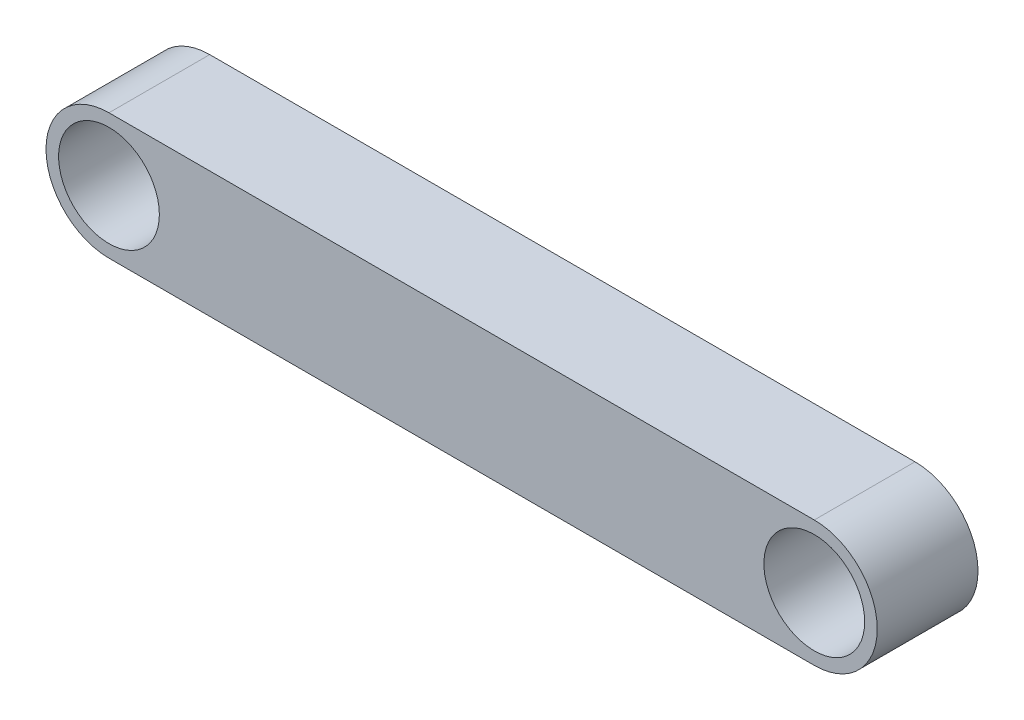
ISO-10303-21;
HEADER;
FILE_DESCRIPTION(('STEP AP214'),'2;1');
FILE_NAME('part.step','',(''),(''),'','','');
FILE_SCHEMA(('AUTOMOTIVE_DESIGN { 1 0 10303 214 1 1 1 1 }'));
ENDSEC;
DATA;
#1=APPLICATION_CONTEXT('core data for automotive mechanical design processes');
#2=APPLICATION_PROTOCOL_DEFINITION('international standard','automotive_design',2000,#1);
#3=PRODUCT_CONTEXT('',#1,'mechanical');
#4=PRODUCT('Part','Part','',(#3));
#5=PRODUCT_RELATED_PRODUCT_CATEGORY('part','',(#4));
#6=PRODUCT_DEFINITION_FORMATION('','',#4);
#7=PRODUCT_DEFINITION_CONTEXT('part definition',#1,'design');
#8=PRODUCT_DEFINITION('design','',#6,#7);
#9=PRODUCT_DEFINITION_SHAPE('','',#8);
#10=(LENGTH_UNIT() NAMED_UNIT(*) SI_UNIT(.MILLI.,.METRE.));
#11=(NAMED_UNIT(*) PLANE_ANGLE_UNIT() SI_UNIT($,.RADIAN.));
#12=(NAMED_UNIT(*) SI_UNIT($,.STERADIAN.) SOLID_ANGLE_UNIT());
#13=UNCERTAINTY_MEASURE_WITH_UNIT(LENGTH_MEASURE(1.E-05),#10,'distance_accuracy_value','');
#14=(GEOMETRIC_REPRESENTATION_CONTEXT(3) GLOBAL_UNCERTAINTY_ASSIGNED_CONTEXT((#13)) GLOBAL_UNIT_ASSIGNED_CONTEXT((#10,
#11,#12)) REPRESENTATION_CONTEXT('',''));
#15=CARTESIAN_POINT('',(0.,0.,0.));
#16=DIRECTION('',(0.,0.,1.));
#17=DIRECTION('',(1.,0.,0.));
#18=AXIS2_PLACEMENT_3D('',#15,#16,#17);
#19=CARTESIAN_POINT('',(0.,0.,10.));
#20=DIRECTION('',(0.,0.,1.));
#21=DIRECTION('',(1.,0.,0.));
#22=AXIS2_PLACEMENT_3D('',#19,#20,#21);
#23=PLANE('',#22);
#24=CARTESIAN_POINT('',(0.,0.,10.));
#25=DIRECTION('',(0.,0.,1.));
#26=DIRECTION('',(1.,0.,0.));
#27=AXIS2_PLACEMENT_3D('',#24,#25,#26);
#28=CIRCLE('',#27,10.);
#29=CARTESIAN_POINT('',(10.,0.,10.));
#30=VERTEX_POINT('',#29);
#31=EDGE_CURVE('E118',#30,#30,#28,.T.);
#32=ORIENTED_EDGE('',*,*,#31,.F.);
#33=EDGE_LOOP('',(#32));
#34=FACE_BOUND('',#33,.T.);
#35=CARTESIAN_POINT('',(0.,0.,10.));
#36=DIRECTION('',(0.,0.,1.));
#37=DIRECTION('',(1.,0.,0.));
#38=AXIS2_PLACEMENT_3D('',#35,#36,#37);
#39=CIRCLE('',#38,12.5);
#40=CARTESIAN_POINT('',(0.,12.5,10.));
#41=VERTEX_POINT('',#40);
#42=CARTESIAN_POINT('',(0.,-12.5,10.));
#43=VERTEX_POINT('',#42);
#44=EDGE_CURVE('E98',#41,#43,#39,.T.);
#45=ORIENTED_EDGE('',*,*,#44,.T.);
#46=DIRECTION('',(1.,0.,0.));
#47=VECTOR('',#46,1.);
#48=CARTESIAN_POINT('',(0.,-12.5,10.));
#49=LINE('',#48,#47);
#50=CARTESIAN_POINT('',(140.,-12.5,10.));
#51=VERTEX_POINT('',#50);
#52=EDGE_CURVE('E93',#43,#51,#49,.T.);
#53=ORIENTED_EDGE('',*,*,#52,.T.);
#54=CARTESIAN_POINT('',(140.,0.,10.));
#55=DIRECTION('',(0.,0.,1.));
#56=DIRECTION('',(1.,0.,0.));
#57=AXIS2_PLACEMENT_3D('',#54,#55,#56);
#58=CIRCLE('',#57,12.5);
#59=CARTESIAN_POINT('',(140.,12.5,10.));
#60=VERTEX_POINT('',#59);
#61=EDGE_CURVE('E96',#51,#60,#58,.T.);
#62=ORIENTED_EDGE('',*,*,#61,.T.);
#63=DIRECTION('',(-1.,0.,0.));
#64=VECTOR('',#63,1.);
#65=CARTESIAN_POINT('',(0.,12.5,10.));
#66=LINE('',#65,#64);
#67=EDGE_CURVE('E63',#60,#41,#66,.T.);
#68=ORIENTED_EDGE('',*,*,#67,.T.);
#69=EDGE_LOOP('',(#45,#53,#62,#68));
#70=FACE_BOUND('',#69,.T.);
#71=CARTESIAN_POINT('',(140.,0.,10.));
#72=DIRECTION('',(0.,0.,1.));
#73=DIRECTION('',(1.,0.,0.));
#74=AXIS2_PLACEMENT_3D('',#71,#72,#73);
#75=CIRCLE('',#74,10.);
#76=CARTESIAN_POINT('',(150.,0.,10.));
#77=VERTEX_POINT('',#76);
#78=EDGE_CURVE('E140',#77,#77,#75,.T.);
#79=ORIENTED_EDGE('',*,*,#78,.F.);
#80=EDGE_LOOP('',(#79));
#81=FACE_BOUND('',#80,.T.);
#82=ADVANCED_FACE('F45',(#34,#70,#81),#23,.T.);
#83=CARTESIAN_POINT('',(0.,0.,-10.));
#84=DIRECTION('',(0.,0.,1.));
#85=DIRECTION('',(1.,0.,0.));
#86=AXIS2_PLACEMENT_3D('',#83,#84,#85);
#87=PLANE('',#86);
#88=CARTESIAN_POINT('',(0.,0.,-10.));
#89=DIRECTION('',(0.,0.,1.));
#90=DIRECTION('',(1.,0.,0.));
#91=AXIS2_PLACEMENT_3D('',#88,#89,#90);
#92=CIRCLE('',#91,12.5);
#93=CARTESIAN_POINT('',(0.,12.5,-10.));
#94=VERTEX_POINT('',#93);
#95=CARTESIAN_POINT('',(0.,-12.5,-10.));
#96=VERTEX_POINT('',#95);
#97=EDGE_CURVE('E114',#94,#96,#92,.T.);
#98=ORIENTED_EDGE('',*,*,#97,.F.);
#99=DIRECTION('',(-1.,0.,0.));
#100=VECTOR('',#99,1.);
#101=CARTESIAN_POINT('',(0.,12.5,-10.));
#102=LINE('',#101,#100);
#103=CARTESIAN_POINT('',(140.,12.5,-10.));
#104=VERTEX_POINT('',#103);
#105=EDGE_CURVE('E86',#104,#94,#102,.T.);
#106=ORIENTED_EDGE('',*,*,#105,.F.);
#107=CARTESIAN_POINT('',(140.,0.,-10.));
#108=DIRECTION('',(0.,0.,1.));
#109=DIRECTION('',(1.,0.,0.));
#110=AXIS2_PLACEMENT_3D('',#107,#108,#109);
#111=CIRCLE('',#110,12.5);
#112=CARTESIAN_POINT('',(140.,-12.5,-10.));
#113=VERTEX_POINT('',#112);
#114=EDGE_CURVE('E80',#113,#104,#111,.T.);
#115=ORIENTED_EDGE('',*,*,#114,.F.);
#116=DIRECTION('',(1.,0.,0.));
#117=VECTOR('',#116,1.);
#118=CARTESIAN_POINT('',(0.,-12.5,-10.));
#119=LINE('',#118,#117);
#120=EDGE_CURVE('E103',#96,#113,#119,.T.);
#121=ORIENTED_EDGE('',*,*,#120,.F.);
#122=EDGE_LOOP('',(#98,#106,#115,#121));
#123=FACE_BOUND('',#122,.T.);
#124=CARTESIAN_POINT('',(0.,0.,-10.));
#125=DIRECTION('',(0.,0.,1.));
#126=DIRECTION('',(1.,0.,0.));
#127=AXIS2_PLACEMENT_3D('',#124,#125,#126);
#128=CIRCLE('',#127,10.);
#129=CARTESIAN_POINT('',(10.,0.,-10.));
#130=VERTEX_POINT('',#129);
#131=EDGE_CURVE('E136',#130,#130,#128,.T.);
#132=ORIENTED_EDGE('',*,*,#131,.T.);
#133=EDGE_LOOP('',(#132));
#134=FACE_BOUND('',#133,.T.);
#135=CARTESIAN_POINT('',(140.,0.,-10.));
#136=DIRECTION('',(0.,0.,1.));
#137=DIRECTION('',(1.,0.,0.));
#138=AXIS2_PLACEMENT_3D('',#135,#136,#137);
#139=CIRCLE('',#138,10.);
#140=CARTESIAN_POINT('',(150.,0.,-10.));
#141=VERTEX_POINT('',#140);
#142=EDGE_CURVE('E144',#141,#141,#139,.T.);
#143=ORIENTED_EDGE('',*,*,#142,.T.);
#144=EDGE_LOOP('',(#143));
#145=FACE_BOUND('',#144,.T.);
#146=ADVANCED_FACE('F131',(#123,#134,#145),#87,.F.);
#147=CARTESIAN_POINT('',(0.,0.,10.));
#148=DIRECTION('',(0.,0.,-1.));
#149=DIRECTION('',(-1.,0.,0.));
#150=AXIS2_PLACEMENT_3D('',#147,#148,#149);
#151=CYLINDRICAL_SURFACE('',#150,12.5);
#152=ORIENTED_EDGE('',*,*,#97,.T.);
#153=DIRECTION('',(0.,0.,-1.));
#154=VECTOR('',#153,1.);
#155=CARTESIAN_POINT('',(0.,-12.5,10.));
#156=LINE('',#155,#154);
#157=EDGE_CURVE('E11',#43,#96,#156,.T.);
#158=ORIENTED_EDGE('',*,*,#157,.F.);
#159=ORIENTED_EDGE('',*,*,#44,.F.);
#160=DIRECTION('',(0.,0.,-1.));
#161=VECTOR('',#160,1.);
#162=CARTESIAN_POINT('',(0.,12.5,10.));
#163=LINE('',#162,#161);
#164=EDGE_CURVE('E110',#41,#94,#163,.T.);
#165=ORIENTED_EDGE('',*,*,#164,.T.);
#166=EDGE_LOOP('',(#152,#158,#159,#165));
#167=FACE_BOUND('',#166,.T.);
#168=ADVANCED_FACE('F47',(#167),#151,.T.);
#169=CARTESIAN_POINT('',(0.,-12.5,10.));
#170=DIRECTION('',(0.,1.,0.));
#171=DIRECTION('',(0.,0.,1.));
#172=AXIS2_PLACEMENT_3D('',#169,#170,#171);
#173=PLANE('',#172);
#174=ORIENTED_EDGE('',*,*,#120,.T.);
#175=DIRECTION('',(0.,0.,-1.));
#176=VECTOR('',#175,1.);
#177=CARTESIAN_POINT('',(140.,-12.5,10.));
#178=LINE('',#177,#176);
#179=EDGE_CURVE('E55',#51,#113,#178,.T.);
#180=ORIENTED_EDGE('',*,*,#179,.F.);
#181=ORIENTED_EDGE('',*,*,#52,.F.);
#182=ORIENTED_EDGE('',*,*,#157,.T.);
#183=EDGE_LOOP('',(#174,#180,#181,#182));
#184=FACE_BOUND('',#183,.T.);
#185=ADVANCED_FACE('F102',(#184),#173,.F.);
#186=CARTESIAN_POINT('',(140.,0.,10.));
#187=DIRECTION('',(0.,0.,-1.));
#188=DIRECTION('',(-1.,0.,0.));
#189=AXIS2_PLACEMENT_3D('',#186,#187,#188);
#190=CYLINDRICAL_SURFACE('',#189,12.5);
#191=ORIENTED_EDGE('',*,*,#114,.T.);
#192=DIRECTION('',(0.,0.,-1.));
#193=VECTOR('',#192,1.);
#194=CARTESIAN_POINT('',(140.,12.5,10.));
#195=LINE('',#194,#193);
#196=EDGE_CURVE('E105',#60,#104,#195,.T.);
#197=ORIENTED_EDGE('',*,*,#196,.F.);
#198=ORIENTED_EDGE('',*,*,#61,.F.);
#199=ORIENTED_EDGE('',*,*,#179,.T.);
#200=EDGE_LOOP('',(#191,#197,#198,#199));
#201=FACE_BOUND('',#200,.T.);
#202=ADVANCED_FACE('F106',(#201),#190,.T.);
#203=CARTESIAN_POINT('',(0.,12.5,10.));
#204=DIRECTION('',(0.,-1.,0.));
#205=DIRECTION('',(0.,0.,-1.));
#206=AXIS2_PLACEMENT_3D('',#203,#204,#205);
#207=PLANE('',#206);
#208=ORIENTED_EDGE('',*,*,#105,.T.);
#209=ORIENTED_EDGE('',*,*,#164,.F.);
#210=ORIENTED_EDGE('',*,*,#67,.F.);
#211=ORIENTED_EDGE('',*,*,#196,.T.);
#212=EDGE_LOOP('',(#208,#209,#210,#211));
#213=FACE_BOUND('',#212,.T.);
#214=ADVANCED_FACE('F128',(#213),#207,.F.);
#215=CARTESIAN_POINT('',(0.,0.,10.));
#216=DIRECTION('',(0.,0.,-1.));
#217=DIRECTION('',(-1.,0.,0.));
#218=AXIS2_PLACEMENT_3D('',#215,#216,#217);
#219=CYLINDRICAL_SURFACE('',#218,10.);
#220=ORIENTED_EDGE('',*,*,#31,.T.);
#221=EDGE_LOOP('',(#220));
#222=FACE_BOUND('',#221,.T.);
#223=ORIENTED_EDGE('',*,*,#131,.F.);
#224=EDGE_LOOP('',(#223));
#225=FACE_BOUND('',#224,.T.);
#226=ADVANCED_FACE('F163',(#222,#225),#219,.F.);
#227=CARTESIAN_POINT('',(140.,0.,10.));
#228=DIRECTION('',(0.,0.,-1.));
#229=DIRECTION('',(-1.,0.,0.));
#230=AXIS2_PLACEMENT_3D('',#227,#228,#229);
#231=CYLINDRICAL_SURFACE('',#230,10.);
#232=ORIENTED_EDGE('',*,*,#78,.T.);
#233=EDGE_LOOP('',(#232));
#234=FACE_BOUND('',#233,.T.);
#235=ORIENTED_EDGE('',*,*,#142,.F.);
#236=EDGE_LOOP('',(#235));
#237=FACE_BOUND('',#236,.T.);
#238=ADVANCED_FACE('F152',(#234,#237),#231,.F.);
#239=CLOSED_SHELL('',(#82,#146,#168,#185,#202,#214,#226,#238));
#240=MANIFOLD_SOLID_BREP('B2',#239);
#241=ADVANCED_BREP_SHAPE_REPRESENTATION('',(#18,#240),#14);
#242=SHAPE_DEFINITION_REPRESENTATION(#9,#241);
ENDSEC;
END-ISO-10303-21;
